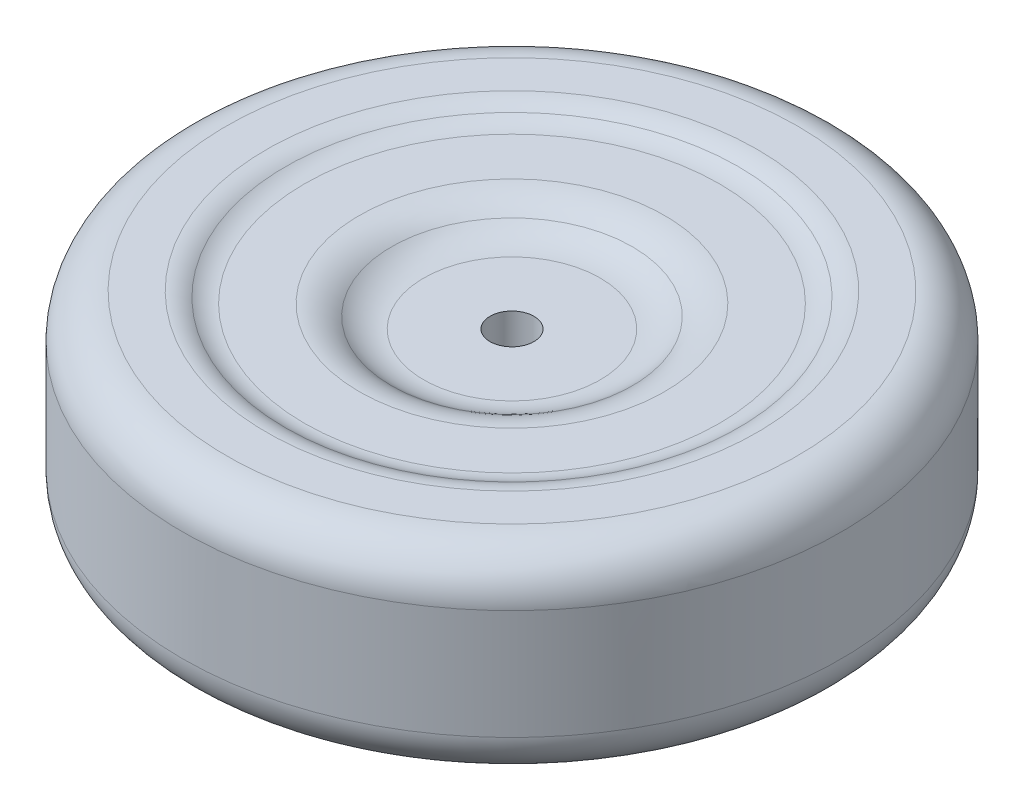
ISO-10303-21;
HEADER;
FILE_DESCRIPTION(('STEP AP214'),'2;1');
FILE_NAME('part.step','',(''),(''),'','','');
FILE_SCHEMA(('AUTOMOTIVE_DESIGN { 1 0 10303 214 1 1 1 1 }'));
ENDSEC;
DATA;
#1=APPLICATION_CONTEXT('core data for automotive mechanical design processes');
#2=APPLICATION_PROTOCOL_DEFINITION('international standard','automotive_design',2000,#1);
#3=PRODUCT_CONTEXT('',#1,'mechanical');
#4=PRODUCT('Part','Part','',(#3));
#5=PRODUCT_RELATED_PRODUCT_CATEGORY('part','',(#4));
#6=PRODUCT_DEFINITION_FORMATION('','',#4);
#7=PRODUCT_DEFINITION_CONTEXT('part definition',#1,'design');
#8=PRODUCT_DEFINITION('design','',#6,#7);
#9=PRODUCT_DEFINITION_SHAPE('','',#8);
#10=(LENGTH_UNIT() NAMED_UNIT(*) SI_UNIT(.MILLI.,.METRE.));
#11=(NAMED_UNIT(*) PLANE_ANGLE_UNIT() SI_UNIT($,.RADIAN.));
#12=(NAMED_UNIT(*) SI_UNIT($,.STERADIAN.) SOLID_ANGLE_UNIT());
#13=UNCERTAINTY_MEASURE_WITH_UNIT(LENGTH_MEASURE(1.E-05),#10,'distance_accuracy_value','');
#14=(GEOMETRIC_REPRESENTATION_CONTEXT(3) GLOBAL_UNCERTAINTY_ASSIGNED_CONTEXT((#13)) GLOBAL_UNIT_ASSIGNED_CONTEXT((#10,
#11,#12)) REPRESENTATION_CONTEXT('',''));
#15=CARTESIAN_POINT('',(0.,0.,0.));
#16=DIRECTION('',(0.,0.,1.));
#17=DIRECTION('',(1.,0.,0.));
#18=AXIS2_PLACEMENT_3D('',#15,#16,#17);
#19=CARTESIAN_POINT('',(0.,25.4,0.));
#20=DIRECTION('',(0.,1.,0.));
#21=DIRECTION('',(0.,0.,1.));
#22=AXIS2_PLACEMENT_3D('',#19,#20,#21);
#23=TOROIDAL_SURFACE('',#22,165.1,25.4);
#24=CARTESIAN_POINT('',(0.,0.,0.));
#25=DIRECTION('',(0.,1.,0.));
#26=DIRECTION('',(0.,0.,1.));
#27=AXIS2_PLACEMENT_3D('',#24,#25,#26);
#28=CIRCLE('',#27,165.1);
#29=CARTESIAN_POINT('',(0.,0.,165.1));
#30=VERTEX_POINT('',#29);
#31=EDGE_CURVE('E10',#30,#30,#28,.F.);
#32=ORIENTED_EDGE('',*,*,#31,.F.);
#33=EDGE_LOOP('',(#32));
#34=FACE_BOUND('',#33,.T.);
#35=CARTESIAN_POINT('',(0.,25.4,0.));
#36=DIRECTION('',(0.,1.,0.));
#37=DIRECTION('',(0.,0.,1.));
#38=AXIS2_PLACEMENT_3D('',#35,#36,#37);
#39=CIRCLE('',#38,190.5);
#40=CARTESIAN_POINT('',(0.,25.4,190.5));
#41=VERTEX_POINT('',#40);
#42=EDGE_CURVE('E49',#41,#41,#39,.T.);
#43=ORIENTED_EDGE('',*,*,#42,.F.);
#44=EDGE_LOOP('',(#43));
#45=FACE_BOUND('',#44,.T.);
#46=ADVANCED_FACE('F43',(#34,#45),#23,.T.);
#47=CARTESIAN_POINT('',(0.,57.15,0.));
#48=DIRECTION('',(0.,-1.,0.));
#49=DIRECTION('',(0.,0.,-1.));
#50=AXIS2_PLACEMENT_3D('',#47,#48,#49);
#51=CYLINDRICAL_SURFACE('',#50,190.5);
#52=ORIENTED_EDGE('',*,*,#42,.T.);
#53=EDGE_LOOP('',(#52));
#54=FACE_BOUND('',#53,.T.);
#55=CARTESIAN_POINT('',(0.,88.9,0.));
#56=DIRECTION('',(0.,-1.,0.));
#57=DIRECTION('',(0.,0.,-1.));
#58=AXIS2_PLACEMENT_3D('',#55,#56,#57);
#59=CIRCLE('',#58,190.5);
#60=CARTESIAN_POINT('',(0.,88.9,-190.5));
#61=VERTEX_POINT('',#60);
#62=EDGE_CURVE('E53',#61,#61,#59,.T.);
#63=ORIENTED_EDGE('',*,*,#62,.T.);
#64=EDGE_LOOP('',(#63));
#65=FACE_BOUND('',#64,.T.);
#66=ADVANCED_FACE('F132',(#54,#65),#51,.T.);
#67=CARTESIAN_POINT('',(0.,0.,0.));
#68=DIRECTION('',(0.,1.,0.));
#69=DIRECTION('',(0.,0.,1.));
#70=AXIS2_PLACEMENT_3D('',#67,#68,#69);
#71=PLANE('',#70);
#72=ORIENTED_EDGE('',*,*,#31,.T.);
#73=EDGE_LOOP('',(#72));
#74=FACE_BOUND('',#73,.T.);
#75=CARTESIAN_POINT('',(0.,0.,0.));
#76=DIRECTION('',(0.,1.,0.));
#77=DIRECTION('',(0.,0.,1.));
#78=AXIS2_PLACEMENT_3D('',#75,#76,#77);
#79=CIRCLE('',#78,141.75606654905);
#80=CARTESIAN_POINT('',(0.,0.,141.75606654905));
#81=VERTEX_POINT('',#80);
#82=EDGE_CURVE('E95',#81,#81,#79,.T.);
#83=ORIENTED_EDGE('',*,*,#82,.T.);
#84=EDGE_LOOP('',(#83));
#85=FACE_BOUND('',#84,.T.);
#86=ADVANCED_FACE('F134',(#74,#85),#71,.F.);
#87=CARTESIAN_POINT('',(0.,6.35,0.));
#88=DIRECTION('',(0.,-1.,0.));
#89=DIRECTION('',(0.,0.,-1.));
#90=AXIS2_PLACEMENT_3D('',#87,#88,#89);
#91=PLANE('',#90);
#92=CARTESIAN_POINT('',(0.,6.35,0.));
#93=DIRECTION('',(0.,-1.,0.));
#94=DIRECTION('',(0.,0.,-1.));
#95=AXIS2_PLACEMENT_3D('',#92,#93,#94);
#96=CIRCLE('',#95,88.2568576358148);
#97=CARTESIAN_POINT('',(0.,6.35,-88.2568576358148));
#98=VERTEX_POINT('',#97);
#99=EDGE_CURVE('E86',#98,#98,#96,.F.);
#100=ORIENTED_EDGE('',*,*,#99,.T.);
#101=EDGE_LOOP('',(#100));
#102=FACE_BOUND('',#101,.T.);
#103=CARTESIAN_POINT('',(0.,6.35,0.));
#104=DIRECTION('',(0.,-1.,0.));
#105=DIRECTION('',(0.,0.,-1.));
#106=AXIS2_PLACEMENT_3D('',#103,#104,#105);
#107=CIRCLE('',#106,119.943100221657);
#108=CARTESIAN_POINT('',(0.,6.35,-119.943100221657));
#109=VERTEX_POINT('',#108);
#110=EDGE_CURVE('E92',#109,#109,#107,.T.);
#111=ORIENTED_EDGE('',*,*,#110,.T.);
#112=EDGE_LOOP('',(#111));
#113=FACE_BOUND('',#112,.T.);
#114=ADVANCED_FACE('F140',(#102,#113),#91,.T.);
#115=CARTESIAN_POINT('',(0.,19.05,0.));
#116=DIRECTION('',(0.,1.,0.));
#117=DIRECTION('',(0.,0.,1.));
#118=AXIS2_PLACEMENT_3D('',#115,#116,#117);
#119=PLANE('',#118);
#120=CARTESIAN_POINT('',(0.,19.05,0.));
#121=DIRECTION('',(0.,1.,0.));
#122=DIRECTION('',(0.,0.,1.));
#123=AXIS2_PLACEMENT_3D('',#120,#121,#122);
#124=CIRCLE('',#123,12.7);
#125=CARTESIAN_POINT('',(0.,19.05,12.7));
#126=VERTEX_POINT('',#125);
#127=EDGE_CURVE('E98',#126,#126,#124,.T.);
#128=ORIENTED_EDGE('',*,*,#127,.T.);
#129=EDGE_LOOP('',(#128));
#130=FACE_BOUND('',#129,.T.);
#131=CARTESIAN_POINT('',(0.,19.05,0.));
#132=DIRECTION('',(0.,1.,0.));
#133=DIRECTION('',(0.,0.,1.));
#134=AXIS2_PLACEMENT_3D('',#131,#132,#133);
#135=CIRCLE('',#134,51.0131467573322);
#136=CARTESIAN_POINT('',(0.,19.05,51.0131467573322));
#137=VERTEX_POINT('',#136);
#138=EDGE_CURVE('E80',#137,#137,#135,.F.);
#139=ORIENTED_EDGE('',*,*,#138,.T.);
#140=EDGE_LOOP('',(#139));
#141=FACE_BOUND('',#140,.T.);
#142=ADVANCED_FACE('F150',(#130,#141),#119,.F.);
#143=CARTESIAN_POINT('',(0.,20.32,0.));
#144=DIRECTION('',(0.,1.,0.));
#145=DIRECTION('',(0.,0.,1.));
#146=AXIS2_PLACEMENT_3D('',#143,#144,#145);
#147=TOROIDAL_SURFACE('',#146,141.75606654905,20.32);
#148=CARTESIAN_POINT('',(0.,3.17500000000048,0.));
#149=DIRECTION('',(0.,1.,0.));
#150=DIRECTION('',(0.,0.,1.));
#151=AXIS2_PLACEMENT_3D('',#148,#149,#150);
#152=CIRCLE('',#151,130.849583385354);
#153=CARTESIAN_POINT('',(0.,3.17500000000048,130.849583385354));
#154=VERTEX_POINT('',#153);
#155=EDGE_CURVE('E89',#154,#154,#152,.T.);
#156=ORIENTED_EDGE('',*,*,#155,.T.);
#157=EDGE_LOOP('',(#156));
#158=FACE_BOUND('',#157,.T.);
#159=ORIENTED_EDGE('',*,*,#82,.F.);
#160=EDGE_LOOP('',(#159));
#161=FACE_BOUND('',#160,.T.);
#162=ADVANCED_FACE('F146',(#158,#161),#147,.T.);
#163=CARTESIAN_POINT('',(0.,-13.97,0.));
#164=DIRECTION('',(0.,1.,0.));
#165=DIRECTION('',(0.,0.,1.));
#166=AXIS2_PLACEMENT_3D('',#163,#164,#165);
#167=TOROIDAL_SURFACE('',#166,119.943100221657,20.32);
#168=ORIENTED_EDGE('',*,*,#155,.F.);
#169=EDGE_LOOP('',(#168));
#170=FACE_BOUND('',#169,.T.);
#171=ORIENTED_EDGE('',*,*,#110,.F.);
#172=EDGE_LOOP('',(#171));
#173=FACE_BOUND('',#172,.T.);
#174=ADVANCED_FACE('F149',(#170,#173),#167,.F.);
#175=CARTESIAN_POINT('',(0.,36.83,0.));
#176=DIRECTION('',(0.,-1.,0.));
#177=DIRECTION('',(0.,0.,-1.));
#178=AXIS2_PLACEMENT_3D('',#175,#176,#177);
#179=TOROIDAL_SURFACE('',#178,88.2568576358148,30.48);
#180=CARTESIAN_POINT('',(0.,12.7,0.));
#181=DIRECTION('',(0.,1.,0.));
#182=DIRECTION('',(0.,0.,1.));
#183=AXIS2_PLACEMENT_3D('',#180,#181,#182);
#184=CIRCLE('',#183,69.6350021965735);
#185=CARTESIAN_POINT('',(0.,12.7,69.6350021965735));
#186=VERTEX_POINT('',#185);
#187=EDGE_CURVE('E83',#186,#186,#184,.T.);
#188=ORIENTED_EDGE('',*,*,#187,.T.);
#189=EDGE_LOOP('',(#188));
#190=FACE_BOUND('',#189,.T.);
#191=ORIENTED_EDGE('',*,*,#99,.F.);
#192=EDGE_LOOP('',(#191));
#193=FACE_BOUND('',#192,.T.);
#194=ADVANCED_FACE('F154',(#190,#193),#179,.T.);
#195=CARTESIAN_POINT('',(0.,-11.43,0.));
#196=DIRECTION('',(0.,-1.,0.));
#197=DIRECTION('',(0.,0.,-1.));
#198=AXIS2_PLACEMENT_3D('',#195,#196,#197);
#199=TOROIDAL_SURFACE('',#198,51.0131467573322,30.48);
#200=ORIENTED_EDGE('',*,*,#138,.F.);
#201=EDGE_LOOP('',(#200));
#202=FACE_BOUND('',#201,.T.);
#203=ORIENTED_EDGE('',*,*,#187,.F.);
#204=EDGE_LOOP('',(#203));
#205=FACE_BOUND('',#204,.T.);
#206=ADVANCED_FACE('F158',(#202,#205),#199,.F.);
#207=CARTESIAN_POINT('',(0.,114.3,0.));
#208=DIRECTION('',(0.,-1.,0.));
#209=DIRECTION('',(0.,0.,1.));
#210=AXIS2_PLACEMENT_3D('',#207,#208,#209);
#211=PLANE('',#210);
#212=CARTESIAN_POINT('',(0.,114.3,0.));
#213=DIRECTION('',(0.,-1.,0.));
#214=DIRECTION('',(0.,0.,-1.));
#215=AXIS2_PLACEMENT_3D('',#212,#213,#214);
#216=CIRCLE('',#215,165.1);
#217=CARTESIAN_POINT('',(0.,114.3,-165.1));
#218=VERTEX_POINT('',#217);
#219=EDGE_CURVE('E57',#218,#218,#216,.F.);
#220=ORIENTED_EDGE('',*,*,#219,.T.);
#221=EDGE_LOOP('',(#220));
#222=FACE_BOUND('',#221,.T.);
#223=CARTESIAN_POINT('',(0.,114.3,0.));
#224=DIRECTION('',(0.,-1.,0.));
#225=DIRECTION('',(0.,0.,-1.));
#226=AXIS2_PLACEMENT_3D('',#223,#224,#225);
#227=CIRCLE('',#226,141.75606654905);
#228=CARTESIAN_POINT('',(0.,114.3,-141.75606654905));
#229=VERTEX_POINT('',#228);
#230=EDGE_CURVE('E77',#229,#229,#227,.T.);
#231=ORIENTED_EDGE('',*,*,#230,.T.);
#232=EDGE_LOOP('',(#231));
#233=FACE_BOUND('',#232,.T.);
#234=ADVANCED_FACE('F162',(#222,#233),#211,.F.);
#235=CARTESIAN_POINT('',(0.,107.95,0.));
#236=DIRECTION('',(0.,1.,0.));
#237=DIRECTION('',(0.,0.,-1.));
#238=AXIS2_PLACEMENT_3D('',#235,#236,#237);
#239=PLANE('',#238);
#240=CARTESIAN_POINT('',(0.,107.95,0.));
#241=DIRECTION('',(0.,1.,0.));
#242=DIRECTION('',(0.,0.,1.));
#243=AXIS2_PLACEMENT_3D('',#240,#241,#242);
#244=CIRCLE('',#243,88.2568576358148);
#245=CARTESIAN_POINT('',(0.,107.95,88.2568576358148));
#246=VERTEX_POINT('',#245);
#247=EDGE_CURVE('E68',#246,#246,#244,.F.);
#248=ORIENTED_EDGE('',*,*,#247,.T.);
#249=EDGE_LOOP('',(#248));
#250=FACE_BOUND('',#249,.T.);
#251=CARTESIAN_POINT('',(0.,107.95,0.));
#252=DIRECTION('',(0.,1.,0.));
#253=DIRECTION('',(0.,0.,1.));
#254=AXIS2_PLACEMENT_3D('',#251,#252,#253);
#255=CIRCLE('',#254,119.943100221657);
#256=CARTESIAN_POINT('',(0.,107.95,119.943100221657));
#257=VERTEX_POINT('',#256);
#258=EDGE_CURVE('E71',#257,#257,#255,.T.);
#259=ORIENTED_EDGE('',*,*,#258,.T.);
#260=EDGE_LOOP('',(#259));
#261=FACE_BOUND('',#260,.T.);
#262=ADVANCED_FACE('F112',(#250,#261),#239,.T.);
#263=CARTESIAN_POINT('',(0.,95.25,0.));
#264=DIRECTION('',(0.,-1.,0.));
#265=DIRECTION('',(0.,0.,1.));
#266=AXIS2_PLACEMENT_3D('',#263,#264,#265);
#267=PLANE('',#266);
#268=CARTESIAN_POINT('',(0.,95.25,0.));
#269=DIRECTION('',(0.,1.,0.));
#270=DIRECTION('',(0.,0.,1.));
#271=AXIS2_PLACEMENT_3D('',#268,#269,#270);
#272=CIRCLE('',#271,12.7);
#273=CARTESIAN_POINT('',(0.,95.25,12.7));
#274=VERTEX_POINT('',#273);
#275=EDGE_CURVE('E101',#274,#274,#272,.T.);
#276=ORIENTED_EDGE('',*,*,#275,.F.);
#277=EDGE_LOOP('',(#276));
#278=FACE_BOUND('',#277,.T.);
#279=CARTESIAN_POINT('',(0.,95.25,0.));
#280=DIRECTION('',(0.,-1.,0.));
#281=DIRECTION('',(0.,0.,-1.));
#282=AXIS2_PLACEMENT_3D('',#279,#280,#281);
#283=CIRCLE('',#282,51.0131467573322);
#284=CARTESIAN_POINT('',(0.,95.25,-51.0131467573322));
#285=VERTEX_POINT('',#284);
#286=EDGE_CURVE('E65',#285,#285,#283,.F.);
#287=ORIENTED_EDGE('',*,*,#286,.T.);
#288=EDGE_LOOP('',(#287));
#289=FACE_BOUND('',#288,.T.);
#290=ADVANCED_FACE('F108',(#278,#289),#267,.F.);
#291=CARTESIAN_POINT('',(0.,93.98,0.));
#292=DIRECTION('',(0.,-1.,0.));
#293=DIRECTION('',(0.,0.,-1.));
#294=AXIS2_PLACEMENT_3D('',#291,#292,#293);
#295=TOROIDAL_SURFACE('',#294,141.75606654905,20.32);
#296=CARTESIAN_POINT('',(0.,111.125,0.));
#297=DIRECTION('',(0.,-1.,0.));
#298=DIRECTION('',(0.,0.,-1.));
#299=AXIS2_PLACEMENT_3D('',#296,#297,#298);
#300=CIRCLE('',#299,130.849583385353);
#301=CARTESIAN_POINT('',(0.,111.125,-130.849583385353));
#302=VERTEX_POINT('',#301);
#303=EDGE_CURVE('E74',#302,#302,#300,.T.);
#304=ORIENTED_EDGE('',*,*,#303,.T.);
#305=EDGE_LOOP('',(#304));
#306=FACE_BOUND('',#305,.T.);
#307=ORIENTED_EDGE('',*,*,#230,.F.);
#308=EDGE_LOOP('',(#307));
#309=FACE_BOUND('',#308,.T.);
#310=ADVANCED_FACE('F111',(#306,#309),#295,.T.);
#311=CARTESIAN_POINT('',(0.,128.27,0.));
#312=DIRECTION('',(0.,-1.,0.));
#313=DIRECTION('',(0.,0.,-1.));
#314=AXIS2_PLACEMENT_3D('',#311,#312,#313);
#315=TOROIDAL_SURFACE('',#314,119.943100221657,20.32);
#316=ORIENTED_EDGE('',*,*,#258,.F.);
#317=EDGE_LOOP('',(#316));
#318=FACE_BOUND('',#317,.T.);
#319=ORIENTED_EDGE('',*,*,#303,.F.);
#320=EDGE_LOOP('',(#319));
#321=FACE_BOUND('',#320,.T.);
#322=ADVANCED_FACE('F128',(#318,#321),#315,.F.);
#323=CARTESIAN_POINT('',(0.,77.47,0.));
#324=DIRECTION('',(0.,1.,0.));
#325=DIRECTION('',(0.,0.,1.));
#326=AXIS2_PLACEMENT_3D('',#323,#324,#325);
#327=TOROIDAL_SURFACE('',#326,88.2568576358148,30.48);
#328=CARTESIAN_POINT('',(0.,101.6,0.));
#329=DIRECTION('',(0.,-1.,0.));
#330=DIRECTION('',(0.,0.,-1.));
#331=AXIS2_PLACEMENT_3D('',#328,#329,#330);
#332=CIRCLE('',#331,69.6350021965736);
#333=CARTESIAN_POINT('',(0.,101.6,-69.6350021965736));
#334=VERTEX_POINT('',#333);
#335=EDGE_CURVE('E62',#334,#334,#332,.T.);
#336=ORIENTED_EDGE('',*,*,#335,.T.);
#337=EDGE_LOOP('',(#336));
#338=FACE_BOUND('',#337,.T.);
#339=ORIENTED_EDGE('',*,*,#247,.F.);
#340=EDGE_LOOP('',(#339));
#341=FACE_BOUND('',#340,.T.);
#342=ADVANCED_FACE('F119',(#338,#341),#327,.T.);
#343=CARTESIAN_POINT('',(0.,125.73,0.));
#344=DIRECTION('',(0.,1.,0.));
#345=DIRECTION('',(0.,0.,1.));
#346=AXIS2_PLACEMENT_3D('',#343,#344,#345);
#347=TOROIDAL_SURFACE('',#346,51.0131467573322,30.48);
#348=ORIENTED_EDGE('',*,*,#335,.F.);
#349=EDGE_LOOP('',(#348));
#350=FACE_BOUND('',#349,.T.);
#351=ORIENTED_EDGE('',*,*,#286,.F.);
#352=EDGE_LOOP('',(#351));
#353=FACE_BOUND('',#352,.T.);
#354=ADVANCED_FACE('F116',(#350,#353),#347,.F.);
#355=CARTESIAN_POINT('',(0.,88.9,0.));
#356=DIRECTION('',(0.,-1.,0.));
#357=DIRECTION('',(0.,0.,-1.));
#358=AXIS2_PLACEMENT_3D('',#355,#356,#357);
#359=TOROIDAL_SURFACE('',#358,165.1,25.4);
#360=ORIENTED_EDGE('',*,*,#62,.F.);
#361=EDGE_LOOP('',(#360));
#362=FACE_BOUND('',#361,.T.);
#363=ORIENTED_EDGE('',*,*,#219,.F.);
#364=EDGE_LOOP('',(#363));
#365=FACE_BOUND('',#364,.T.);
#366=ADVANCED_FACE('F118',(#362,#365),#359,.T.);
#367=CARTESIAN_POINT('',(0.,-945.388,0.));
#368=DIRECTION('',(0.,1.,0.));
#369=DIRECTION('',(0.,0.,1.));
#370=AXIS2_PLACEMENT_3D('',#367,#368,#369);
#371=CYLINDRICAL_SURFACE('',#370,12.7);
#372=ORIENTED_EDGE('',*,*,#275,.T.);
#373=EDGE_LOOP('',(#372));
#374=FACE_BOUND('',#373,.T.);
#375=ORIENTED_EDGE('',*,*,#127,.F.);
#376=EDGE_LOOP('',(#375));
#377=FACE_BOUND('',#376,.T.);
#378=ADVANCED_FACE('F105',(#374,#377),#371,.F.);
#379=CLOSED_SHELL('',(#46,#66,#86,#114,#142,#162,#174,#194,#206,#234,#262,#290,#310,#322,#342,
#354,#366,#378));
#380=MANIFOLD_SOLID_BREP('B2',#379);
#381=ADVANCED_BREP_SHAPE_REPRESENTATION('',(#18,#380),#14);
#382=SHAPE_DEFINITION_REPRESENTATION(#9,#381);
ENDSEC;
END-ISO-10303-21;
